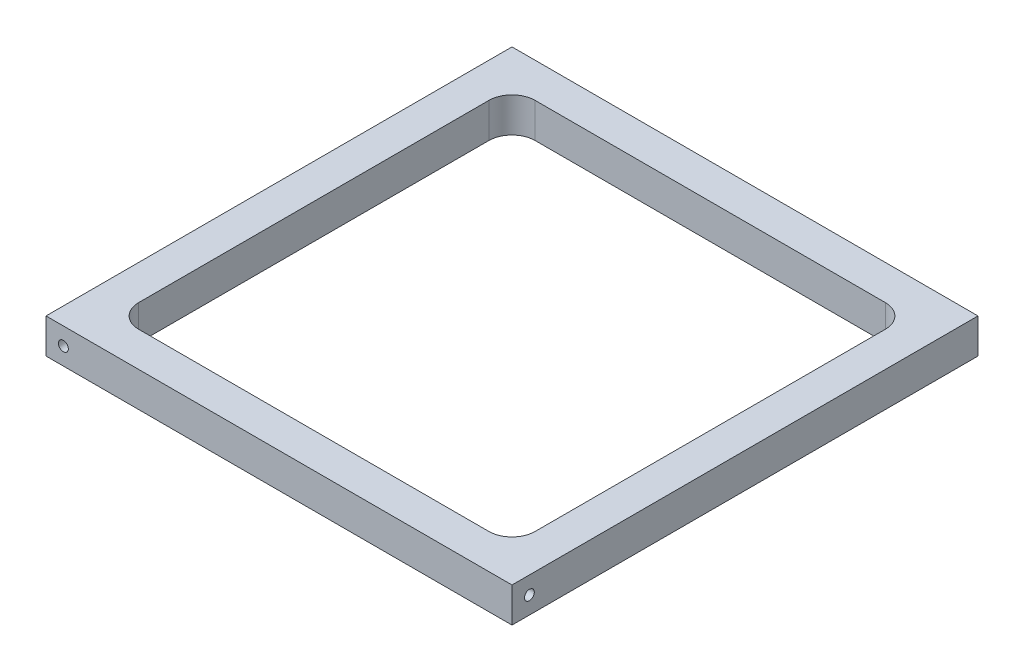
ISO-10303-21;
HEADER;
FILE_DESCRIPTION(('STEP AP214'),'2;1');
FILE_NAME('part.step','',(''),(''),'','','');
FILE_SCHEMA(('AUTOMOTIVE_DESIGN { 1 0 10303 214 1 1 1 1 }'));
ENDSEC;
DATA;
#1=APPLICATION_CONTEXT('core data for automotive mechanical design processes');
#2=APPLICATION_PROTOCOL_DEFINITION('international standard','automotive_design',2000,#1);
#3=PRODUCT_CONTEXT('',#1,'mechanical');
#4=PRODUCT('Part','Part','',(#3));
#5=PRODUCT_RELATED_PRODUCT_CATEGORY('part','',(#4));
#6=PRODUCT_DEFINITION_FORMATION('','',#4);
#7=PRODUCT_DEFINITION_CONTEXT('part definition',#1,'design');
#8=PRODUCT_DEFINITION('design','',#6,#7);
#9=PRODUCT_DEFINITION_SHAPE('','',#8);
#10=(LENGTH_UNIT() NAMED_UNIT(*) SI_UNIT(.MILLI.,.METRE.));
#11=(NAMED_UNIT(*) PLANE_ANGLE_UNIT() SI_UNIT($,.RADIAN.));
#12=(NAMED_UNIT(*) SI_UNIT($,.STERADIAN.) SOLID_ANGLE_UNIT());
#13=UNCERTAINTY_MEASURE_WITH_UNIT(LENGTH_MEASURE(1.E-05),#10,'distance_accuracy_value','');
#14=(GEOMETRIC_REPRESENTATION_CONTEXT(3) GLOBAL_UNCERTAINTY_ASSIGNED_CONTEXT((#13)) GLOBAL_UNIT_ASSIGNED_CONTEXT((#10,
#11,#12)) REPRESENTATION_CONTEXT('',''));
#15=CARTESIAN_POINT('',(0.,0.,0.));
#16=DIRECTION('',(0.,0.,1.));
#17=DIRECTION('',(1.,0.,0.));
#18=AXIS2_PLACEMENT_3D('',#15,#16,#17);
#19=CARTESIAN_POINT('',(0.,9.525,0.));
#20=DIRECTION('',(-1.,0.,0.));
#21=DIRECTION('',(0.,0.,1.));
#22=AXIS2_PLACEMENT_3D('',#19,#20,#21);
#23=PLANE('',#22);
#24=CARTESIAN_POINT('',(0.,4.7625,-122.8725));
#25=DIRECTION('',(-1.,0.,0.));
#26=DIRECTION('',(0.,0.,1.));
#27=AXIS2_PLACEMENT_3D('',#24,#25,#26);
#28=CIRCLE('',#27,1.35254999999999);
#29=CARTESIAN_POINT('',(0.,4.7625,-121.51995));
#30=VERTEX_POINT('',#29);
#31=EDGE_CURVE('E145',#30,#30,#28,.T.);
#32=ORIENTED_EDGE('',*,*,#31,.F.);
#33=EDGE_LOOP('',(#32));
#34=FACE_BOUND('',#33,.T.);
#35=DIRECTION('',(0.,0.,-1.));
#36=VECTOR('',#35,1.);
#37=CARTESIAN_POINT('',(0.,0.,0.));
#38=LINE('',#37,#36);
#39=CARTESIAN_POINT('',(0.,0.,0.));
#40=VERTEX_POINT('',#39);
#41=CARTESIAN_POINT('',(0.,0.,-127.635));
#42=VERTEX_POINT('',#41);
#43=EDGE_CURVE('E181',#40,#42,#38,.T.);
#44=ORIENTED_EDGE('',*,*,#43,.F.);
#45=DIRECTION('',(0.,-1.,0.));
#46=VECTOR('',#45,1.);
#47=CARTESIAN_POINT('',(0.,9.525,0.));
#48=LINE('',#47,#46);
#49=CARTESIAN_POINT('',(0.,9.525,0.));
#50=VERTEX_POINT('',#49);
#51=EDGE_CURVE('E212',#50,#40,#48,.T.);
#52=ORIENTED_EDGE('',*,*,#51,.F.);
#53=DIRECTION('',(0.,0.,-1.));
#54=VECTOR('',#53,1.);
#55=CARTESIAN_POINT('',(0.,9.525,0.));
#56=LINE('',#55,#54);
#57=CARTESIAN_POINT('',(0.,9.525,-127.635));
#58=VERTEX_POINT('',#57);
#59=EDGE_CURVE('E191',#50,#58,#56,.T.);
#60=ORIENTED_EDGE('',*,*,#59,.T.);
#61=DIRECTION('',(0.,-1.,0.));
#62=VECTOR('',#61,1.);
#63=CARTESIAN_POINT('',(0.,9.525,-127.635));
#64=LINE('',#63,#62);
#65=EDGE_CURVE('E202',#58,#42,#64,.T.);
#66=ORIENTED_EDGE('',*,*,#65,.T.);
#67=EDGE_LOOP('',(#44,#52,#60,#66));
#68=FACE_BOUND('',#67,.T.);
#69=ADVANCED_FACE('F35',(#34,#68),#23,.T.);
#70=CARTESIAN_POINT('',(0.,9.525,0.));
#71=DIRECTION('',(0.,0.,-1.));
#72=DIRECTION('',(-1.,0.,0.));
#73=AXIS2_PLACEMENT_3D('',#70,#71,#72);
#74=PLANE('',#73);
#75=CARTESIAN_POINT('',(4.7625,4.7625,0.));
#76=DIRECTION('',(0.,0.,1.));
#77=DIRECTION('',(1.,0.,0.));
#78=AXIS2_PLACEMENT_3D('',#75,#76,#77);
#79=CIRCLE('',#78,1.35254999999999);
#80=CARTESIAN_POINT('',(6.11504999999999,4.7625,0.));
#81=VERTEX_POINT('',#80);
#82=EDGE_CURVE('E156',#81,#81,#79,.T.);
#83=ORIENTED_EDGE('',*,*,#82,.F.);
#84=EDGE_LOOP('',(#83));
#85=FACE_BOUND('',#84,.T.);
#86=DIRECTION('',(1.,0.,0.));
#87=VECTOR('',#86,1.);
#88=CARTESIAN_POINT('',(0.,0.,0.));
#89=LINE('',#88,#87);
#90=CARTESIAN_POINT('',(127.635,0.,0.));
#91=VERTEX_POINT('',#90);
#92=EDGE_CURVE('E195',#40,#91,#89,.T.);
#93=ORIENTED_EDGE('',*,*,#92,.T.);
#94=DIRECTION('',(0.,-1.,0.));
#95=VECTOR('',#94,1.);
#96=CARTESIAN_POINT('',(127.635,9.525,0.));
#97=LINE('',#96,#95);
#98=CARTESIAN_POINT('',(127.635,9.525,0.));
#99=VERTEX_POINT('',#98);
#100=EDGE_CURVE('E215',#99,#91,#97,.T.);
#101=ORIENTED_EDGE('',*,*,#100,.F.);
#102=DIRECTION('',(1.,0.,0.));
#103=VECTOR('',#102,1.);
#104=CARTESIAN_POINT('',(0.,9.525,0.));
#105=LINE('',#104,#103);
#106=EDGE_CURVE('E200',#50,#99,#105,.T.);
#107=ORIENTED_EDGE('',*,*,#106,.F.);
#108=ORIENTED_EDGE('',*,*,#51,.T.);
#109=EDGE_LOOP('',(#93,#101,#107,#108));
#110=FACE_BOUND('',#109,.T.);
#111=ADVANCED_FACE('F292',(#85,#110),#74,.F.);
#112=CARTESIAN_POINT('',(127.635,9.525,0.));
#113=DIRECTION('',(-1.,0.,0.));
#114=DIRECTION('',(0.,0.,1.));
#115=AXIS2_PLACEMENT_3D('',#112,#113,#114);
#116=PLANE('',#115);
#117=CARTESIAN_POINT('',(127.635,4.7625,-4.7625));
#118=DIRECTION('',(1.,0.,0.));
#119=DIRECTION('',(0.,0.,-1.));
#120=AXIS2_PLACEMENT_3D('',#117,#118,#119);
#121=CIRCLE('',#120,1.35254999999999);
#122=CARTESIAN_POINT('',(127.635,4.7625,-6.11504999999999));
#123=VERTEX_POINT('',#122);
#124=EDGE_CURVE('E162',#123,#123,#121,.T.);
#125=ORIENTED_EDGE('',*,*,#124,.F.);
#126=EDGE_LOOP('',(#125));
#127=FACE_BOUND('',#126,.T.);
#128=DIRECTION('',(0.,0.,-1.));
#129=VECTOR('',#128,1.);
#130=CARTESIAN_POINT('',(127.635,0.,0.));
#131=LINE('',#130,#129);
#132=CARTESIAN_POINT('',(127.635,0.,-127.635));
#133=VERTEX_POINT('',#132);
#134=EDGE_CURVE('E208',#91,#133,#131,.T.);
#135=ORIENTED_EDGE('',*,*,#134,.T.);
#136=DIRECTION('',(0.,-1.,0.));
#137=VECTOR('',#136,1.);
#138=CARTESIAN_POINT('',(127.635,9.525,-127.635));
#139=LINE('',#138,#137);
#140=CARTESIAN_POINT('',(127.635,9.525,-127.635));
#141=VERTEX_POINT('',#140);
#142=EDGE_CURVE('E218',#141,#133,#139,.T.);
#143=ORIENTED_EDGE('',*,*,#142,.F.);
#144=DIRECTION('',(0.,0.,-1.));
#145=VECTOR('',#144,1.);
#146=CARTESIAN_POINT('',(127.635,9.525,0.));
#147=LINE('',#146,#145);
#148=EDGE_CURVE('E198',#99,#141,#147,.T.);
#149=ORIENTED_EDGE('',*,*,#148,.F.);
#150=ORIENTED_EDGE('',*,*,#100,.T.);
#151=EDGE_LOOP('',(#135,#143,#149,#150));
#152=FACE_BOUND('',#151,.T.);
#153=ADVANCED_FACE('F298',(#127,#152),#116,.F.);
#154=CARTESIAN_POINT('',(0.,9.525,-127.635));
#155=DIRECTION('',(0.,0.,-1.));
#156=DIRECTION('',(-1.,0.,0.));
#157=AXIS2_PLACEMENT_3D('',#154,#155,#156);
#158=PLANE('',#157);
#159=CARTESIAN_POINT('',(122.8725,4.7625,-127.635));
#160=DIRECTION('',(0.,0.,-1.));
#161=DIRECTION('',(-1.,0.,0.));
#162=AXIS2_PLACEMENT_3D('',#159,#160,#161);
#163=CIRCLE('',#162,1.35254999999999);
#164=CARTESIAN_POINT('',(121.51995,4.7625,-127.635));
#165=VERTEX_POINT('',#164);
#166=EDGE_CURVE('E146',#165,#165,#163,.T.);
#167=ORIENTED_EDGE('',*,*,#166,.F.);
#168=EDGE_LOOP('',(#167));
#169=FACE_BOUND('',#168,.T.);
#170=DIRECTION('',(1.,0.,0.));
#171=VECTOR('',#170,1.);
#172=CARTESIAN_POINT('',(0.,0.,-127.635));
#173=LINE('',#172,#171);
#174=EDGE_CURVE('E205',#42,#133,#173,.T.);
#175=ORIENTED_EDGE('',*,*,#174,.F.);
#176=ORIENTED_EDGE('',*,*,#65,.F.);
#177=DIRECTION('',(1.,0.,0.));
#178=VECTOR('',#177,1.);
#179=CARTESIAN_POINT('',(0.,9.525,-127.635));
#180=LINE('',#179,#178);
#181=EDGE_CURVE('E194',#58,#141,#180,.T.);
#182=ORIENTED_EDGE('',*,*,#181,.T.);
#183=ORIENTED_EDGE('',*,*,#142,.T.);
#184=EDGE_LOOP('',(#175,#176,#182,#183));
#185=FACE_BOUND('',#184,.T.);
#186=ADVANCED_FACE('F305',(#169,#185),#158,.T.);
#187=CARTESIAN_POINT('',(0.,9.525,0.));
#188=DIRECTION('',(0.,-1.,0.));
#189=DIRECTION('',(0.,0.,-1.));
#190=AXIS2_PLACEMENT_3D('',#187,#188,#189);
#191=PLANE('',#190);
#192=DIRECTION('',(1.,0.,0.));
#193=VECTOR('',#192,1.);
#194=CARTESIAN_POINT('',(9.52499999999999,9.525,-118.11));
#195=LINE('',#194,#193);
#196=CARTESIAN_POINT('',(15.875,9.525,-118.11));
#197=VERTEX_POINT('',#196);
#198=CARTESIAN_POINT('',(111.76,9.525,-118.11));
#199=VERTEX_POINT('',#198);
#200=EDGE_CURVE('E187',#197,#199,#195,.T.);
#201=ORIENTED_EDGE('',*,*,#200,.T.);
#202=CARTESIAN_POINT('',(111.76,9.525,-111.76));
#203=DIRECTION('',(0.,-1.,0.));
#204=DIRECTION('',(0.,0.,-1.));
#205=AXIS2_PLACEMENT_3D('',#202,#203,#204);
#206=CIRCLE('',#205,6.35);
#207=CARTESIAN_POINT('',(118.11,9.525,-111.76));
#208=VERTEX_POINT('',#207);
#209=EDGE_CURVE('E243',#199,#208,#206,.T.);
#210=ORIENTED_EDGE('',*,*,#209,.T.);
#211=DIRECTION('',(0.,0.,1.));
#212=VECTOR('',#211,1.);
#213=CARTESIAN_POINT('',(118.11,9.525,-118.11));
#214=LINE('',#213,#212);
#215=CARTESIAN_POINT('',(118.11,9.525,-15.875));
#216=VERTEX_POINT('',#215);
#217=EDGE_CURVE('E184',#208,#216,#214,.T.);
#218=ORIENTED_EDGE('',*,*,#217,.T.);
#219=CARTESIAN_POINT('',(111.76,9.525,-15.875));
#220=DIRECTION('',(0.,-1.,0.));
#221=DIRECTION('',(0.,0.,-1.));
#222=AXIS2_PLACEMENT_3D('',#219,#220,#221);
#223=CIRCLE('',#222,6.35);
#224=CARTESIAN_POINT('',(111.76,9.525,-9.52500000000001));
#225=VERTEX_POINT('',#224);
#226=EDGE_CURVE('E239',#216,#225,#223,.T.);
#227=ORIENTED_EDGE('',*,*,#226,.T.);
#228=DIRECTION('',(1.,0.,0.));
#229=VECTOR('',#228,1.);
#230=CARTESIAN_POINT('',(9.52500000000001,9.525,-9.52500000000001));
#231=LINE('',#230,#229);
#232=CARTESIAN_POINT('',(15.875,9.525,-9.52500000000001));
#233=VERTEX_POINT('',#232);
#234=EDGE_CURVE('E168',#233,#225,#231,.T.);
#235=ORIENTED_EDGE('',*,*,#234,.F.);
#236=CARTESIAN_POINT('',(15.875,9.525,-15.875));
#237=DIRECTION('',(0.,-1.,0.));
#238=DIRECTION('',(0.,0.,-1.));
#239=AXIS2_PLACEMENT_3D('',#236,#237,#238);
#240=CIRCLE('',#239,6.35);
#241=CARTESIAN_POINT('',(9.52500000000001,9.525,-15.875));
#242=VERTEX_POINT('',#241);
#243=EDGE_CURVE('E43',#233,#242,#240,.T.);
#244=ORIENTED_EDGE('',*,*,#243,.T.);
#245=DIRECTION('',(0.,0.,1.));
#246=VECTOR('',#245,1.);
#247=CARTESIAN_POINT('',(9.52499999999999,9.525,-118.11));
#248=LINE('',#247,#246);
#249=CARTESIAN_POINT('',(9.52499999999999,9.525,-111.76));
#250=VERTEX_POINT('',#249);
#251=EDGE_CURVE('E173',#250,#242,#248,.T.);
#252=ORIENTED_EDGE('',*,*,#251,.F.);
#253=CARTESIAN_POINT('',(15.875,9.525,-111.76));
#254=DIRECTION('',(0.,-1.,0.));
#255=DIRECTION('',(0.,0.,-1.));
#256=AXIS2_PLACEMENT_3D('',#253,#254,#255);
#257=CIRCLE('',#256,6.35);
#258=EDGE_CURVE('E247',#250,#197,#257,.T.);
#259=ORIENTED_EDGE('',*,*,#258,.T.);
#260=EDGE_LOOP('',(#201,#210,#218,#227,#235,#244,#252,#259));
#261=FACE_BOUND('',#260,.T.);
#262=ORIENTED_EDGE('',*,*,#59,.F.);
#263=ORIENTED_EDGE('',*,*,#106,.T.);
#264=ORIENTED_EDGE('',*,*,#148,.T.);
#265=ORIENTED_EDGE('',*,*,#181,.F.);
#266=EDGE_LOOP('',(#262,#263,#264,#265));
#267=FACE_BOUND('',#266,.T.);
#268=ADVANCED_FACE('F252',(#261,#267),#191,.F.);
#269=CARTESIAN_POINT('',(0.,0.,0.));
#270=DIRECTION('',(0.,-1.,0.));
#271=DIRECTION('',(0.,0.,-1.));
#272=AXIS2_PLACEMENT_3D('',#269,#270,#271);
#273=PLANE('',#272);
#274=DIRECTION('',(0.,0.,1.));
#275=VECTOR('',#274,1.);
#276=CARTESIAN_POINT('',(9.52499999999999,0.,-118.11));
#277=LINE('',#276,#275);
#278=CARTESIAN_POINT('',(9.52499999999999,0.,-111.76));
#279=VERTEX_POINT('',#278);
#280=CARTESIAN_POINT('',(9.52500000000001,0.,-15.875));
#281=VERTEX_POINT('',#280);
#282=EDGE_CURVE('E179',#279,#281,#277,.T.);
#283=ORIENTED_EDGE('',*,*,#282,.T.);
#284=CARTESIAN_POINT('',(15.875,0.,-15.875));
#285=DIRECTION('',(0.,-1.,0.));
#286=DIRECTION('',(0.,0.,-1.));
#287=AXIS2_PLACEMENT_3D('',#284,#285,#286);
#288=CIRCLE('',#287,6.35);
#289=CARTESIAN_POINT('',(15.875,0.,-9.52500000000001));
#290=VERTEX_POINT('',#289);
#291=EDGE_CURVE('E11',#281,#290,#288,.F.);
#292=ORIENTED_EDGE('',*,*,#291,.T.);
#293=DIRECTION('',(1.,0.,0.));
#294=VECTOR('',#293,1.);
#295=CARTESIAN_POINT('',(9.52500000000001,0.,-9.52500000000001));
#296=LINE('',#295,#294);
#297=CARTESIAN_POINT('',(111.76,0.,-9.52500000000001));
#298=VERTEX_POINT('',#297);
#299=EDGE_CURVE('E169',#290,#298,#296,.T.);
#300=ORIENTED_EDGE('',*,*,#299,.T.);
#301=CARTESIAN_POINT('',(111.76,0.,-15.875));
#302=DIRECTION('',(0.,-1.,0.));
#303=DIRECTION('',(0.,0.,-1.));
#304=AXIS2_PLACEMENT_3D('',#301,#302,#303);
#305=CIRCLE('',#304,6.35);
#306=CARTESIAN_POINT('',(118.11,0.,-15.875));
#307=VERTEX_POINT('',#306);
#308=EDGE_CURVE('E241',#298,#307,#305,.F.);
#309=ORIENTED_EDGE('',*,*,#308,.T.);
#310=DIRECTION('',(0.,0.,1.));
#311=VECTOR('',#310,1.);
#312=CARTESIAN_POINT('',(118.11,0.,-118.11));
#313=LINE('',#312,#311);
#314=CARTESIAN_POINT('',(118.11,0.,-111.76));
#315=VERTEX_POINT('',#314);
#316=EDGE_CURVE('E172',#315,#307,#313,.T.);
#317=ORIENTED_EDGE('',*,*,#316,.F.);
#318=CARTESIAN_POINT('',(111.76,0.,-111.76));
#319=DIRECTION('',(0.,-1.,0.));
#320=DIRECTION('',(0.,0.,-1.));
#321=AXIS2_PLACEMENT_3D('',#318,#319,#320);
#322=CIRCLE('',#321,6.35);
#323=CARTESIAN_POINT('',(111.76,0.,-118.11));
#324=VERTEX_POINT('',#323);
#325=EDGE_CURVE('E245',#315,#324,#322,.F.);
#326=ORIENTED_EDGE('',*,*,#325,.T.);
#327=DIRECTION('',(1.,0.,0.));
#328=VECTOR('',#327,1.);
#329=CARTESIAN_POINT('',(9.52499999999999,0.,-118.11));
#330=LINE('',#329,#328);
#331=CARTESIAN_POINT('',(15.875,0.,-118.11));
#332=VERTEX_POINT('',#331);
#333=EDGE_CURVE('E176',#332,#324,#330,.T.);
#334=ORIENTED_EDGE('',*,*,#333,.F.);
#335=CARTESIAN_POINT('',(15.875,0.,-111.76));
#336=DIRECTION('',(0.,-1.,0.));
#337=DIRECTION('',(0.,0.,-1.));
#338=AXIS2_PLACEMENT_3D('',#335,#336,#337);
#339=CIRCLE('',#338,6.35);
#340=EDGE_CURVE('E57',#332,#279,#339,.F.);
#341=ORIENTED_EDGE('',*,*,#340,.T.);
#342=EDGE_LOOP('',(#283,#292,#300,#309,#317,#326,#334,#341));
#343=FACE_BOUND('',#342,.T.);
#344=ORIENTED_EDGE('',*,*,#43,.T.);
#345=ORIENTED_EDGE('',*,*,#174,.T.);
#346=ORIENTED_EDGE('',*,*,#134,.F.);
#347=ORIENTED_EDGE('',*,*,#92,.F.);
#348=EDGE_LOOP('',(#344,#345,#346,#347));
#349=FACE_BOUND('',#348,.T.);
#350=ADVANCED_FACE('F260',(#343,#349),#273,.T.);
#351=CARTESIAN_POINT('',(9.52500000000001,0.,-9.52500000000001));
#352=DIRECTION('',(0.,0.,1.));
#353=DIRECTION('',(1.,0.,0.));
#354=AXIS2_PLACEMENT_3D('',#351,#352,#353);
#355=PLANE('',#354);
#356=ORIENTED_EDGE('',*,*,#234,.T.);
#357=DIRECTION('',(0.,1.,0.));
#358=VECTOR('',#357,1.);
#359=CARTESIAN_POINT('',(111.76,0.,-9.52500000000001));
#360=LINE('',#359,#358);
#361=EDGE_CURVE('E228',#225,#298,#360,.F.);
#362=ORIENTED_EDGE('',*,*,#361,.T.);
#363=ORIENTED_EDGE('',*,*,#299,.F.);
#364=DIRECTION('',(0.,1.,0.));
#365=VECTOR('',#364,1.);
#366=CARTESIAN_POINT('',(15.875,9.525,-9.52500000000001));
#367=LINE('',#366,#365);
#368=EDGE_CURVE('E225',#290,#233,#367,.T.);
#369=ORIENTED_EDGE('',*,*,#368,.T.);
#370=EDGE_LOOP('',(#356,#362,#363,#369));
#371=FACE_BOUND('',#370,.T.);
#372=ADVANCED_FACE('F264',(#371),#355,.F.);
#373=CARTESIAN_POINT('',(9.52499999999999,0.,-118.11));
#374=DIRECTION('',(-1.,0.,0.));
#375=DIRECTION('',(0.,0.,1.));
#376=AXIS2_PLACEMENT_3D('',#373,#374,#375);
#377=PLANE('',#376);
#378=ORIENTED_EDGE('',*,*,#282,.F.);
#379=DIRECTION('',(0.,1.,0.));
#380=VECTOR('',#379,1.);
#381=CARTESIAN_POINT('',(9.52499999999999,0.,-111.76));
#382=LINE('',#381,#380);
#383=EDGE_CURVE('E236',#279,#250,#382,.T.);
#384=ORIENTED_EDGE('',*,*,#383,.T.);
#385=ORIENTED_EDGE('',*,*,#251,.T.);
#386=DIRECTION('',(0.,1.,0.));
#387=VECTOR('',#386,1.);
#388=CARTESIAN_POINT('',(9.52500000000001,0.,-15.875));
#389=LINE('',#388,#387);
#390=EDGE_CURVE('E50',#242,#281,#389,.F.);
#391=ORIENTED_EDGE('',*,*,#390,.T.);
#392=EDGE_LOOP('',(#378,#384,#385,#391));
#393=FACE_BOUND('',#392,.T.);
#394=ADVANCED_FACE('F256',(#393),#377,.F.);
#395=CARTESIAN_POINT('',(9.52499999999999,0.,-118.11));
#396=DIRECTION('',(0.,0.,1.));
#397=DIRECTION('',(1.,0.,0.));
#398=AXIS2_PLACEMENT_3D('',#395,#396,#397);
#399=PLANE('',#398);
#400=ORIENTED_EDGE('',*,*,#333,.T.);
#401=DIRECTION('',(0.,1.,0.));
#402=VECTOR('',#401,1.);
#403=CARTESIAN_POINT('',(111.76,9.525,-118.11));
#404=LINE('',#403,#402);
#405=EDGE_CURVE('E232',#324,#199,#404,.T.);
#406=ORIENTED_EDGE('',*,*,#405,.T.);
#407=ORIENTED_EDGE('',*,*,#200,.F.);
#408=DIRECTION('',(0.,1.,0.));
#409=VECTOR('',#408,1.);
#410=CARTESIAN_POINT('',(15.875,0.,-118.11));
#411=LINE('',#410,#409);
#412=EDGE_CURVE('E230',#197,#332,#411,.F.);
#413=ORIENTED_EDGE('',*,*,#412,.T.);
#414=EDGE_LOOP('',(#400,#406,#407,#413));
#415=FACE_BOUND('',#414,.T.);
#416=ADVANCED_FACE('F279',(#415),#399,.T.);
#417=CARTESIAN_POINT('',(118.11,0.,-118.11));
#418=DIRECTION('',(-1.,0.,0.));
#419=DIRECTION('',(0.,0.,1.));
#420=AXIS2_PLACEMENT_3D('',#417,#418,#419);
#421=PLANE('',#420);
#422=ORIENTED_EDGE('',*,*,#316,.T.);
#423=DIRECTION('',(0.,1.,0.));
#424=VECTOR('',#423,1.);
#425=CARTESIAN_POINT('',(118.11,0.,-15.875));
#426=LINE('',#425,#424);
#427=EDGE_CURVE('E222',#307,#216,#426,.T.);
#428=ORIENTED_EDGE('',*,*,#427,.T.);
#429=ORIENTED_EDGE('',*,*,#217,.F.);
#430=DIRECTION('',(0.,1.,0.));
#431=VECTOR('',#430,1.);
#432=CARTESIAN_POINT('',(118.11,0.,-111.76));
#433=LINE('',#432,#431);
#434=EDGE_CURVE('E214',#208,#315,#433,.F.);
#435=ORIENTED_EDGE('',*,*,#434,.T.);
#436=EDGE_LOOP('',(#422,#428,#429,#435));
#437=FACE_BOUND('',#436,.T.);
#438=ADVANCED_FACE('F272',(#437),#421,.T.);
#439=CARTESIAN_POINT('',(111.76,0.,-15.875));
#440=DIRECTION('',(0.,1.,0.));
#441=DIRECTION('',(0.,0.,1.));
#442=AXIS2_PLACEMENT_3D('',#439,#440,#441);
#443=CYLINDRICAL_SURFACE('',#442,6.35);
#444=ORIENTED_EDGE('',*,*,#308,.F.);
#445=ORIENTED_EDGE('',*,*,#361,.F.);
#446=ORIENTED_EDGE('',*,*,#226,.F.);
#447=ORIENTED_EDGE('',*,*,#427,.F.);
#448=EDGE_LOOP('',(#444,#445,#446,#447));
#449=FACE_BOUND('',#448,.T.);
#450=ADVANCED_FACE('F267',(#449),#443,.F.);
#451=CARTESIAN_POINT('',(111.76,0.,-111.76));
#452=DIRECTION('',(0.,-1.,0.));
#453=DIRECTION('',(0.,0.,-1.));
#454=AXIS2_PLACEMENT_3D('',#451,#452,#453);
#455=CYLINDRICAL_SURFACE('',#454,6.35);
#456=ORIENTED_EDGE('',*,*,#325,.F.);
#457=ORIENTED_EDGE('',*,*,#434,.F.);
#458=ORIENTED_EDGE('',*,*,#209,.F.);
#459=ORIENTED_EDGE('',*,*,#405,.F.);
#460=EDGE_LOOP('',(#456,#457,#458,#459));
#461=FACE_BOUND('',#460,.T.);
#462=ADVANCED_FACE('F276',(#461),#455,.F.);
#463=CARTESIAN_POINT('',(15.875,0.,-111.76));
#464=DIRECTION('',(0.,1.,0.));
#465=DIRECTION('',(0.,0.,1.));
#466=AXIS2_PLACEMENT_3D('',#463,#464,#465);
#467=CYLINDRICAL_SURFACE('',#466,6.35);
#468=ORIENTED_EDGE('',*,*,#340,.F.);
#469=ORIENTED_EDGE('',*,*,#412,.F.);
#470=ORIENTED_EDGE('',*,*,#258,.F.);
#471=ORIENTED_EDGE('',*,*,#383,.F.);
#472=EDGE_LOOP('',(#468,#469,#470,#471));
#473=FACE_BOUND('',#472,.T.);
#474=ADVANCED_FACE('F283',(#473),#467,.F.);
#475=CARTESIAN_POINT('',(15.875,0.,-15.875));
#476=DIRECTION('',(0.,-1.,0.));
#477=DIRECTION('',(0.,0.,-1.));
#478=AXIS2_PLACEMENT_3D('',#475,#476,#477);
#479=CYLINDRICAL_SURFACE('',#478,6.35);
#480=ORIENTED_EDGE('',*,*,#291,.F.);
#481=ORIENTED_EDGE('',*,*,#390,.F.);
#482=ORIENTED_EDGE('',*,*,#243,.F.);
#483=ORIENTED_EDGE('',*,*,#368,.F.);
#484=EDGE_LOOP('',(#480,#481,#482,#483));
#485=FACE_BOUND('',#484,.T.);
#486=ADVANCED_FACE('F37',(#485),#479,.F.);
#487=CARTESIAN_POINT('',(114.935,4.7625,-4.7625));
#488=DIRECTION('',(1.,0.,0.));
#489=DIRECTION('',(0.,0.,-1.));
#490=AXIS2_PLACEMENT_3D('',#487,#488,#489);
#491=CONICAL_SURFACE('',#490,1.35254999999999,1.02974425867665);
#492=CARTESIAN_POINT('',(114.122305969734,4.7625,-4.7625));
#493=VERTEX_POINT('',#492);
#494=VERTEX_LOOP('',#493);
#495=FACE_BOUND('',#494,.T.);
#496=CARTESIAN_POINT('',(114.935,4.7625,-4.7625));
#497=DIRECTION('',(1.,0.,0.));
#498=DIRECTION('',(0.,0.,-1.));
#499=AXIS2_PLACEMENT_3D('',#496,#497,#498);
#500=CIRCLE('',#499,1.35254999999999);
#501=CARTESIAN_POINT('',(114.935,4.7625,-6.11504999999998));
#502=VERTEX_POINT('',#501);
#503=EDGE_CURVE('E165',#502,#502,#500,.T.);
#504=ORIENTED_EDGE('',*,*,#503,.T.);
#505=EDGE_LOOP('',(#504));
#506=FACE_BOUND('',#505,.T.);
#507=ADVANCED_FACE('F289',(#495,#506),#491,.F.);
#508=CARTESIAN_POINT('',(127.635,4.7625,-4.7625));
#509=DIRECTION('',(1.,0.,0.));
#510=DIRECTION('',(0.,0.,-1.));
#511=AXIS2_PLACEMENT_3D('',#508,#509,#510);
#512=CYLINDRICAL_SURFACE('',#511,1.35254999999999);
#513=ORIENTED_EDGE('',*,*,#503,.F.);
#514=EDGE_LOOP('',(#513));
#515=FACE_BOUND('',#514,.T.);
#516=ORIENTED_EDGE('',*,*,#124,.T.);
#517=EDGE_LOOP('',(#516));
#518=FACE_BOUND('',#517,.T.);
#519=ADVANCED_FACE('F344',(#515,#518),#512,.F.);
#520=CARTESIAN_POINT('',(4.7625,4.7625,-12.7));
#521=DIRECTION('',(0.,0.,1.));
#522=DIRECTION('',(1.,0.,0.));
#523=AXIS2_PLACEMENT_3D('',#520,#521,#522);
#524=CONICAL_SURFACE('',#523,1.35254999999999,1.02974425867665);
#525=CARTESIAN_POINT('',(4.7625,4.7625,-13.5126940302657));
#526=VERTEX_POINT('',#525);
#527=VERTEX_LOOP('',#526);
#528=FACE_BOUND('',#527,.T.);
#529=CARTESIAN_POINT('',(4.7625,4.7625,-12.7));
#530=DIRECTION('',(0.,0.,1.));
#531=DIRECTION('',(1.,0.,0.));
#532=AXIS2_PLACEMENT_3D('',#529,#530,#531);
#533=CIRCLE('',#532,1.35254999999999);
#534=CARTESIAN_POINT('',(6.11504999999999,4.7625,-12.7));
#535=VERTEX_POINT('',#534);
#536=EDGE_CURVE('E159',#535,#535,#533,.T.);
#537=ORIENTED_EDGE('',*,*,#536,.T.);
#538=EDGE_LOOP('',(#537));
#539=FACE_BOUND('',#538,.T.);
#540=ADVANCED_FACE('F346',(#528,#539),#524,.F.);
#541=CARTESIAN_POINT('',(4.7625,4.7625,0.));
#542=DIRECTION('',(0.,0.,1.));
#543=DIRECTION('',(1.,0.,0.));
#544=AXIS2_PLACEMENT_3D('',#541,#542,#543);
#545=CYLINDRICAL_SURFACE('',#544,1.35254999999999);
#546=ORIENTED_EDGE('',*,*,#536,.F.);
#547=EDGE_LOOP('',(#546));
#548=FACE_BOUND('',#547,.T.);
#549=ORIENTED_EDGE('',*,*,#82,.T.);
#550=EDGE_LOOP('',(#549));
#551=FACE_BOUND('',#550,.T.);
#552=ADVANCED_FACE('F353',(#548,#551),#545,.F.);
#553=CARTESIAN_POINT('',(12.7,4.7625,-122.8725));
#554=DIRECTION('',(-1.,0.,0.));
#555=DIRECTION('',(0.,0.,1.));
#556=AXIS2_PLACEMENT_3D('',#553,#554,#555);
#557=CONICAL_SURFACE('',#556,1.35254999999999,1.02974425867665);
#558=CARTESIAN_POINT('',(13.5126940302657,4.7625,-122.8725));
#559=VERTEX_POINT('',#558);
#560=VERTEX_LOOP('',#559);
#561=FACE_BOUND('',#560,.T.);
#562=CARTESIAN_POINT('',(12.7,4.7625,-122.8725));
#563=DIRECTION('',(-1.,0.,0.));
#564=DIRECTION('',(0.,0.,1.));
#565=AXIS2_PLACEMENT_3D('',#562,#563,#564);
#566=CIRCLE('',#565,1.35254999999999);
#567=CARTESIAN_POINT('',(12.7,4.7625,-121.51995));
#568=VERTEX_POINT('',#567);
#569=EDGE_CURVE('E149',#568,#568,#566,.T.);
#570=ORIENTED_EDGE('',*,*,#569,.T.);
#571=EDGE_LOOP('',(#570));
#572=FACE_BOUND('',#571,.T.);
#573=ADVANCED_FACE('F429',(#561,#572),#557,.F.);
#574=CARTESIAN_POINT('',(0.,4.7625,-122.8725));
#575=DIRECTION('',(-1.,0.,0.));
#576=DIRECTION('',(0.,0.,1.));
#577=AXIS2_PLACEMENT_3D('',#574,#575,#576);
#578=CYLINDRICAL_SURFACE('',#577,1.35254999999999);
#579=ORIENTED_EDGE('',*,*,#569,.F.);
#580=EDGE_LOOP('',(#579));
#581=FACE_BOUND('',#580,.T.);
#582=ORIENTED_EDGE('',*,*,#31,.T.);
#583=EDGE_LOOP('',(#582));
#584=FACE_BOUND('',#583,.T.);
#585=ADVANCED_FACE('F139',(#581,#584),#578,.F.);
#586=CARTESIAN_POINT('',(122.8725,4.7625,-114.935));
#587=DIRECTION('',(0.,0.,-1.));
#588=DIRECTION('',(-1.,0.,0.));
#589=AXIS2_PLACEMENT_3D('',#586,#587,#588);
#590=CONICAL_SURFACE('',#589,1.35254999999998,1.02974425867665);
#591=CARTESIAN_POINT('',(122.8725,4.7625,-114.122305969734));
#592=VERTEX_POINT('',#591);
#593=VERTEX_LOOP('',#592);
#594=FACE_BOUND('',#593,.T.);
#595=CARTESIAN_POINT('',(122.8725,4.7625,-114.935));
#596=DIRECTION('',(0.,0.,-1.));
#597=DIRECTION('',(-1.,0.,0.));
#598=AXIS2_PLACEMENT_3D('',#595,#596,#597);
#599=CIRCLE('',#598,1.35254999999998);
#600=CARTESIAN_POINT('',(121.51995,4.7625,-114.935));
#601=VERTEX_POINT('',#600);
#602=EDGE_CURVE('E143',#601,#601,#599,.T.);
#603=ORIENTED_EDGE('',*,*,#602,.T.);
#604=EDGE_LOOP('',(#603));
#605=FACE_BOUND('',#604,.T.);
#606=ADVANCED_FACE('F135',(#594,#605),#590,.F.);
#607=CARTESIAN_POINT('',(122.8725,4.7625,-127.635));
#608=DIRECTION('',(0.,0.,-1.));
#609=DIRECTION('',(-1.,0.,0.));
#610=AXIS2_PLACEMENT_3D('',#607,#608,#609);
#611=CYLINDRICAL_SURFACE('',#610,1.35254999999999);
#612=ORIENTED_EDGE('',*,*,#602,.F.);
#613=EDGE_LOOP('',(#612));
#614=FACE_BOUND('',#613,.T.);
#615=ORIENTED_EDGE('',*,*,#166,.T.);
#616=EDGE_LOOP('',(#615));
#617=FACE_BOUND('',#616,.T.);
#618=ADVANCED_FACE('F138',(#614,#617),#611,.F.);
#619=CLOSED_SHELL('',(#69,#111,#153,#186,#268,#350,#372,#394,#416,#438,#450,#462,#474,#486,#507,
#519,#540,#552,#573,#585,#606,#618));
#620=MANIFOLD_SOLID_BREP('B2',#619);
#621=ADVANCED_BREP_SHAPE_REPRESENTATION('',(#18,#620),#14);
#622=SHAPE_DEFINITION_REPRESENTATION(#9,#621);
ENDSEC;
END-ISO-10303-21;
